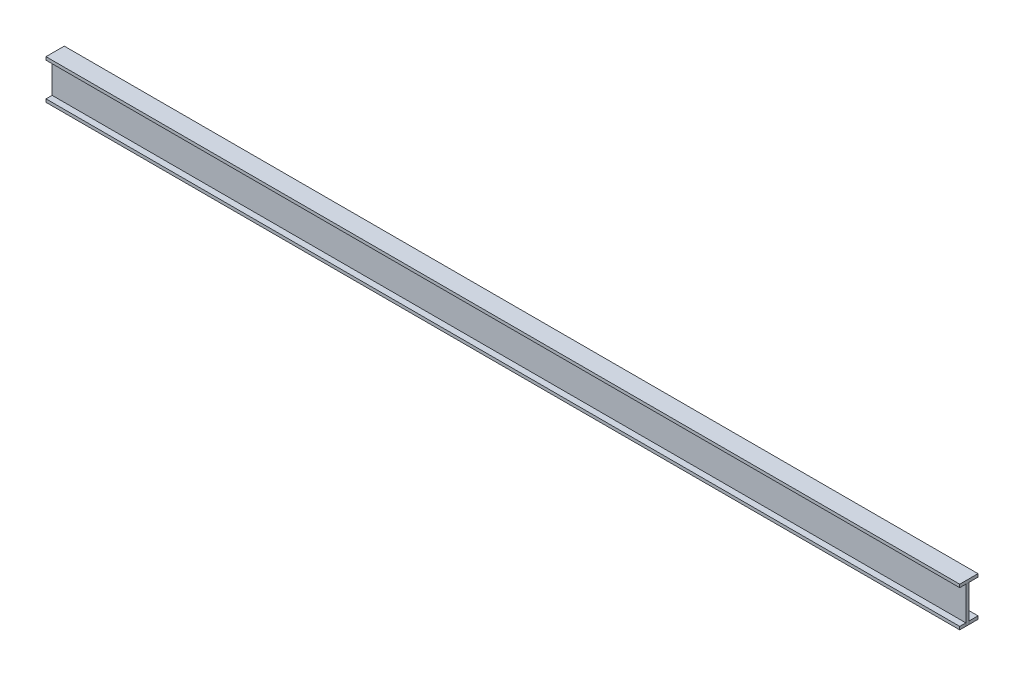
ISO-10303-21;
HEADER;
FILE_DESCRIPTION(('STEP AP214'),'2;1');
FILE_NAME('part.step','',(''),(''),'','','');
FILE_SCHEMA(('AUTOMOTIVE_DESIGN { 1 0 10303 214 1 1 1 1 }'));
ENDSEC;
DATA;
#1=APPLICATION_CONTEXT('core data for automotive mechanical design processes');
#2=APPLICATION_PROTOCOL_DEFINITION('international standard','automotive_design',2000,#1);
#3=PRODUCT_CONTEXT('',#1,'mechanical');
#4=PRODUCT('Part','Part','',(#3));
#5=PRODUCT_RELATED_PRODUCT_CATEGORY('part','',(#4));
#6=PRODUCT_DEFINITION_FORMATION('','',#4);
#7=PRODUCT_DEFINITION_CONTEXT('part definition',#1,'design');
#8=PRODUCT_DEFINITION('design','',#6,#7);
#9=PRODUCT_DEFINITION_SHAPE('','',#8);
#10=(LENGTH_UNIT() NAMED_UNIT(*) SI_UNIT(.MILLI.,.METRE.));
#11=(NAMED_UNIT(*) PLANE_ANGLE_UNIT() SI_UNIT($,.RADIAN.));
#12=(NAMED_UNIT(*) SI_UNIT($,.STERADIAN.) SOLID_ANGLE_UNIT());
#13=UNCERTAINTY_MEASURE_WITH_UNIT(LENGTH_MEASURE(1.E-05),#10,'distance_accuracy_value','');
#14=(GEOMETRIC_REPRESENTATION_CONTEXT(3) GLOBAL_UNCERTAINTY_ASSIGNED_CONTEXT((#13)) GLOBAL_UNIT_ASSIGNED_CONTEXT((#10,
#11,#12)) REPRESENTATION_CONTEXT('',''));
#15=CARTESIAN_POINT('',(0.,0.,0.));
#16=DIRECTION('',(0.,0.,1.));
#17=DIRECTION('',(1.,0.,0.));
#18=AXIS2_PLACEMENT_3D('',#15,#16,#17);
#19=CARTESIAN_POINT('',(3000.,120.,30.));
#20=DIRECTION('',(0.,1.,0.));
#21=DIRECTION('',(0.,0.,1.));
#22=AXIS2_PLACEMENT_3D('',#19,#20,#21);
#23=PLANE('',#22);
#24=DIRECTION('',(0.,0.,-1.));
#25=VECTOR('',#24,1.);
#26=CARTESIAN_POINT('',(0.,120.,30.));
#27=LINE('',#26,#25);
#28=CARTESIAN_POINT('',(0.,120.,30.));
#29=VERTEX_POINT('',#28);
#30=CARTESIAN_POINT('',(0.,120.,-30.));
#31=VERTEX_POINT('',#30);
#32=EDGE_CURVE('E158',#29,#31,#27,.T.);
#33=ORIENTED_EDGE('',*,*,#32,.T.);
#34=DIRECTION('',(-1.,0.,0.));
#35=VECTOR('',#34,1.);
#36=CARTESIAN_POINT('',(3000.,120.,-30.));
#37=LINE('',#36,#35);
#38=CARTESIAN_POINT('',(3000.,120.,-30.));
#39=VERTEX_POINT('',#38);
#40=EDGE_CURVE('E13',#39,#31,#37,.T.);
#41=ORIENTED_EDGE('',*,*,#40,.F.);
#42=DIRECTION('',(0.,0.,-1.));
#43=VECTOR('',#42,1.);
#44=CARTESIAN_POINT('',(3000.,120.,30.));
#45=LINE('',#44,#43);
#46=CARTESIAN_POINT('',(3000.,120.,30.));
#47=VERTEX_POINT('',#46);
#48=EDGE_CURVE('E135',#47,#39,#45,.T.);
#49=ORIENTED_EDGE('',*,*,#48,.F.);
#50=DIRECTION('',(-1.,0.,0.));
#51=VECTOR('',#50,1.);
#52=CARTESIAN_POINT('',(3000.,120.,30.));
#53=LINE('',#52,#51);
#54=EDGE_CURVE('E111',#47,#29,#53,.T.);
#55=ORIENTED_EDGE('',*,*,#54,.T.);
#56=EDGE_LOOP('',(#33,#41,#49,#55));
#57=FACE_BOUND('',#56,.T.);
#58=ADVANCED_FACE('F95',(#57),#23,.F.);
#59=CARTESIAN_POINT('',(3000.,130.,-30.));
#60=DIRECTION('',(0.,0.,-1.));
#61=DIRECTION('',(-1.,0.,0.));
#62=AXIS2_PLACEMENT_3D('',#59,#60,#61);
#63=PLANE('',#62);
#64=DIRECTION('',(0.,-1.,0.));
#65=VECTOR('',#64,1.);
#66=CARTESIAN_POINT('',(0.,130.,-30.));
#67=LINE('',#66,#65);
#68=CARTESIAN_POINT('',(0.,130.,-30.));
#69=VERTEX_POINT('',#68);
#70=EDGE_CURVE('E144',#69,#31,#67,.T.);
#71=ORIENTED_EDGE('',*,*,#70,.F.);
#72=DIRECTION('',(-1.,0.,0.));
#73=VECTOR('',#72,1.);
#74=CARTESIAN_POINT('',(3000.,130.,-30.));
#75=LINE('',#74,#73);
#76=CARTESIAN_POINT('',(3000.,130.,-30.));
#77=VERTEX_POINT('',#76);
#78=EDGE_CURVE('E103',#77,#69,#75,.T.);
#79=ORIENTED_EDGE('',*,*,#78,.F.);
#80=DIRECTION('',(0.,-1.,0.));
#81=VECTOR('',#80,1.);
#82=CARTESIAN_POINT('',(3000.,130.,-30.));
#83=LINE('',#82,#81);
#84=EDGE_CURVE('E142',#77,#39,#83,.T.);
#85=ORIENTED_EDGE('',*,*,#84,.T.);
#86=ORIENTED_EDGE('',*,*,#40,.T.);
#87=EDGE_LOOP('',(#71,#79,#85,#86));
#88=FACE_BOUND('',#87,.T.);
#89=ADVANCED_FACE('F141',(#88),#63,.T.);
#90=CARTESIAN_POINT('',(3000.,130.,30.));
#91=DIRECTION('',(0.,1.,0.));
#92=DIRECTION('',(0.,0.,1.));
#93=AXIS2_PLACEMENT_3D('',#90,#91,#92);
#94=PLANE('',#93);
#95=DIRECTION('',(0.,0.,-1.));
#96=VECTOR('',#95,1.);
#97=CARTESIAN_POINT('',(0.,130.,30.));
#98=LINE('',#97,#96);
#99=CARTESIAN_POINT('',(0.,130.,30.));
#100=VERTEX_POINT('',#99);
#101=EDGE_CURVE('E161',#100,#69,#98,.T.);
#102=ORIENTED_EDGE('',*,*,#101,.F.);
#103=DIRECTION('',(-1.,0.,0.));
#104=VECTOR('',#103,1.);
#105=CARTESIAN_POINT('',(3000.,130.,30.));
#106=LINE('',#105,#104);
#107=CARTESIAN_POINT('',(3000.,130.,30.));
#108=VERTEX_POINT('',#107);
#109=EDGE_CURVE('E124',#108,#100,#106,.T.);
#110=ORIENTED_EDGE('',*,*,#109,.F.);
#111=DIRECTION('',(0.,0.,-1.));
#112=VECTOR('',#111,1.);
#113=CARTESIAN_POINT('',(3000.,130.,30.));
#114=LINE('',#113,#112);
#115=EDGE_CURVE('E150',#108,#77,#114,.T.);
#116=ORIENTED_EDGE('',*,*,#115,.T.);
#117=ORIENTED_EDGE('',*,*,#78,.T.);
#118=EDGE_LOOP('',(#102,#110,#116,#117));
#119=FACE_BOUND('',#118,.T.);
#120=ADVANCED_FACE('F152',(#119),#94,.T.);
#121=CARTESIAN_POINT('',(3000.,120.,30.));
#122=DIRECTION('',(0.,0.,1.));
#123=DIRECTION('',(1.,0.,0.));
#124=AXIS2_PLACEMENT_3D('',#121,#122,#123);
#125=PLANE('',#124);
#126=DIRECTION('',(0.,1.,0.));
#127=VECTOR('',#126,1.);
#128=CARTESIAN_POINT('',(0.,120.,30.));
#129=LINE('',#128,#127);
#130=EDGE_CURVE('E163',#29,#100,#129,.T.);
#131=ORIENTED_EDGE('',*,*,#130,.F.);
#132=ORIENTED_EDGE('',*,*,#54,.F.);
#133=DIRECTION('',(0.,1.,0.));
#134=VECTOR('',#133,1.);
#135=CARTESIAN_POINT('',(3000.,120.,30.));
#136=LINE('',#135,#134);
#137=EDGE_CURVE('E153',#47,#108,#136,.T.);
#138=ORIENTED_EDGE('',*,*,#137,.T.);
#139=ORIENTED_EDGE('',*,*,#109,.T.);
#140=EDGE_LOOP('',(#131,#132,#138,#139));
#141=FACE_BOUND('',#140,.T.);
#142=ADVANCED_FACE('F169',(#141),#125,.T.);
#143=CARTESIAN_POINT('',(3000.,0.,0.));
#144=DIRECTION('',(-1.,0.,0.));
#145=DIRECTION('',(0.,0.,1.));
#146=AXIS2_PLACEMENT_3D('',#143,#144,#145);
#147=PLANE('',#146);
#148=ORIENTED_EDGE('',*,*,#48,.T.);
#149=ORIENTED_EDGE('',*,*,#84,.F.);
#150=ORIENTED_EDGE('',*,*,#115,.F.);
#151=ORIENTED_EDGE('',*,*,#137,.F.);
#152=EDGE_LOOP('',(#148,#149,#150,#151));
#153=FACE_BOUND('',#152,.T.);
#154=ADVANCED_FACE('F149',(#153),#147,.F.);
#155=CARTESIAN_POINT('',(0.,0.,0.));
#156=DIRECTION('',(-1.,0.,0.));
#157=DIRECTION('',(0.,0.,1.));
#158=AXIS2_PLACEMENT_3D('',#155,#156,#157);
#159=PLANE('',#158);
#160=ORIENTED_EDGE('',*,*,#32,.F.);
#161=ORIENTED_EDGE('',*,*,#130,.T.);
#162=ORIENTED_EDGE('',*,*,#101,.T.);
#163=ORIENTED_EDGE('',*,*,#70,.T.);
#164=EDGE_LOOP('',(#160,#161,#162,#163));
#165=FACE_BOUND('',#164,.T.);
#166=ADVANCED_FACE('F168',(#165),#159,.T.);
#167=CLOSED_SHELL('',(#58,#89,#120,#142,#154,#166));
#168=MANIFOLD_SOLID_BREP('B2',#167);
#169=CARTESIAN_POINT('',(3000.,0.,0.));
#170=DIRECTION('',(0.,0.,1.));
#171=DIRECTION('',(1.,0.,0.));
#172=AXIS2_PLACEMENT_3D('',#169,#170,#171);
#173=PLANE('',#172);
#174=DIRECTION('',(0.,1.,0.));
#175=VECTOR('',#174,1.);
#176=CARTESIAN_POINT('',(0.,0.,0.));
#177=LINE('',#176,#175);
#178=CARTESIAN_POINT('',(0.,0.,0.));
#179=VERTEX_POINT('',#178);
#180=CARTESIAN_POINT('',(0.,120.,0.));
#181=VERTEX_POINT('',#180);
#182=EDGE_CURVE('E290',#179,#181,#177,.T.);
#183=ORIENTED_EDGE('',*,*,#182,.T.);
#184=DIRECTION('',(-1.,0.,0.));
#185=VECTOR('',#184,1.);
#186=CARTESIAN_POINT('',(3000.,120.,0.));
#187=LINE('',#186,#185);
#188=CARTESIAN_POINT('',(3000.,120.,0.));
#189=VERTEX_POINT('',#188);
#190=EDGE_CURVE('E93',#189,#181,#187,.T.);
#191=ORIENTED_EDGE('',*,*,#190,.F.);
#192=DIRECTION('',(0.,1.,0.));
#193=VECTOR('',#192,1.);
#194=CARTESIAN_POINT('',(3000.,0.,0.));
#195=LINE('',#194,#193);
#196=CARTESIAN_POINT('',(3000.,0.,0.));
#197=VERTEX_POINT('',#196);
#198=EDGE_CURVE('E267',#197,#189,#195,.T.);
#199=ORIENTED_EDGE('',*,*,#198,.F.);
#200=DIRECTION('',(-1.,0.,0.));
#201=VECTOR('',#200,1.);
#202=CARTESIAN_POINT('',(3000.,0.,0.));
#203=LINE('',#202,#201);
#204=EDGE_CURVE('E243',#197,#179,#203,.T.);
#205=ORIENTED_EDGE('',*,*,#204,.T.);
#206=EDGE_LOOP('',(#183,#191,#199,#205));
#207=FACE_BOUND('',#206,.T.);
#208=ADVANCED_FACE('F227',(#207),#173,.F.);
#209=CARTESIAN_POINT('',(3000.,120.,10.));
#210=DIRECTION('',(0.,1.,0.));
#211=DIRECTION('',(0.,0.,1.));
#212=AXIS2_PLACEMENT_3D('',#209,#210,#211);
#213=PLANE('',#212);
#214=DIRECTION('',(0.,0.,-1.));
#215=VECTOR('',#214,1.);
#216=CARTESIAN_POINT('',(0.,120.,10.));
#217=LINE('',#216,#215);
#218=CARTESIAN_POINT('',(0.,120.,10.));
#219=VERTEX_POINT('',#218);
#220=EDGE_CURVE('E276',#219,#181,#217,.T.);
#221=ORIENTED_EDGE('',*,*,#220,.F.);
#222=DIRECTION('',(-1.,0.,0.));
#223=VECTOR('',#222,1.);
#224=CARTESIAN_POINT('',(3000.,120.,10.));
#225=LINE('',#224,#223);
#226=CARTESIAN_POINT('',(3000.,120.,10.));
#227=VERTEX_POINT('',#226);
#228=EDGE_CURVE('E235',#227,#219,#225,.T.);
#229=ORIENTED_EDGE('',*,*,#228,.F.);
#230=DIRECTION('',(0.,0.,-1.));
#231=VECTOR('',#230,1.);
#232=CARTESIAN_POINT('',(3000.,120.,10.));
#233=LINE('',#232,#231);
#234=EDGE_CURVE('E274',#227,#189,#233,.T.);
#235=ORIENTED_EDGE('',*,*,#234,.T.);
#236=ORIENTED_EDGE('',*,*,#190,.T.);
#237=EDGE_LOOP('',(#221,#229,#235,#236));
#238=FACE_BOUND('',#237,.T.);
#239=ADVANCED_FACE('F273',(#238),#213,.T.);
#240=CARTESIAN_POINT('',(3000.,0.,10.));
#241=DIRECTION('',(0.,0.,1.));
#242=DIRECTION('',(1.,0.,0.));
#243=AXIS2_PLACEMENT_3D('',#240,#241,#242);
#244=PLANE('',#243);
#245=DIRECTION('',(0.,1.,0.));
#246=VECTOR('',#245,1.);
#247=CARTESIAN_POINT('',(0.,0.,10.));
#248=LINE('',#247,#246);
#249=CARTESIAN_POINT('',(0.,0.,10.));
#250=VERTEX_POINT('',#249);
#251=EDGE_CURVE('E293',#250,#219,#248,.T.);
#252=ORIENTED_EDGE('',*,*,#251,.F.);
#253=DIRECTION('',(-1.,0.,0.));
#254=VECTOR('',#253,1.);
#255=CARTESIAN_POINT('',(3000.,0.,10.));
#256=LINE('',#255,#254);
#257=CARTESIAN_POINT('',(3000.,0.,10.));
#258=VERTEX_POINT('',#257);
#259=EDGE_CURVE('E256',#258,#250,#256,.T.);
#260=ORIENTED_EDGE('',*,*,#259,.F.);
#261=DIRECTION('',(0.,1.,0.));
#262=VECTOR('',#261,1.);
#263=CARTESIAN_POINT('',(3000.,0.,10.));
#264=LINE('',#263,#262);
#265=EDGE_CURVE('E282',#258,#227,#264,.T.);
#266=ORIENTED_EDGE('',*,*,#265,.T.);
#267=ORIENTED_EDGE('',*,*,#228,.T.);
#268=EDGE_LOOP('',(#252,#260,#266,#267));
#269=FACE_BOUND('',#268,.T.);
#270=ADVANCED_FACE('F284',(#269),#244,.T.);
#271=CARTESIAN_POINT('',(3000.,0.,0.));
#272=DIRECTION('',(0.,-1.,0.));
#273=DIRECTION('',(0.,0.,-1.));
#274=AXIS2_PLACEMENT_3D('',#271,#272,#273);
#275=PLANE('',#274);
#276=DIRECTION('',(0.,0.,1.));
#277=VECTOR('',#276,1.);
#278=CARTESIAN_POINT('',(0.,0.,0.));
#279=LINE('',#278,#277);
#280=EDGE_CURVE('E295',#179,#250,#279,.T.);
#281=ORIENTED_EDGE('',*,*,#280,.F.);
#282=ORIENTED_EDGE('',*,*,#204,.F.);
#283=DIRECTION('',(0.,0.,1.));
#284=VECTOR('',#283,1.);
#285=CARTESIAN_POINT('',(3000.,0.,0.));
#286=LINE('',#285,#284);
#287=EDGE_CURVE('E285',#197,#258,#286,.T.);
#288=ORIENTED_EDGE('',*,*,#287,.T.);
#289=ORIENTED_EDGE('',*,*,#259,.T.);
#290=EDGE_LOOP('',(#281,#282,#288,#289));
#291=FACE_BOUND('',#290,.T.);
#292=ADVANCED_FACE('F301',(#291),#275,.T.);
#293=CARTESIAN_POINT('',(3000.,0.,0.));
#294=DIRECTION('',(-1.,0.,0.));
#295=DIRECTION('',(0.,0.,1.));
#296=AXIS2_PLACEMENT_3D('',#293,#294,#295);
#297=PLANE('',#296);
#298=ORIENTED_EDGE('',*,*,#198,.T.);
#299=ORIENTED_EDGE('',*,*,#234,.F.);
#300=ORIENTED_EDGE('',*,*,#265,.F.);
#301=ORIENTED_EDGE('',*,*,#287,.F.);
#302=EDGE_LOOP('',(#298,#299,#300,#301));
#303=FACE_BOUND('',#302,.T.);
#304=ADVANCED_FACE('F281',(#303),#297,.F.);
#305=CARTESIAN_POINT('',(0.,0.,0.));
#306=DIRECTION('',(-1.,0.,0.));
#307=DIRECTION('',(0.,0.,1.));
#308=AXIS2_PLACEMENT_3D('',#305,#306,#307);
#309=PLANE('',#308);
#310=ORIENTED_EDGE('',*,*,#182,.F.);
#311=ORIENTED_EDGE('',*,*,#280,.T.);
#312=ORIENTED_EDGE('',*,*,#251,.T.);
#313=ORIENTED_EDGE('',*,*,#220,.T.);
#314=EDGE_LOOP('',(#310,#311,#312,#313));
#315=FACE_BOUND('',#314,.T.);
#316=ADVANCED_FACE('F300',(#315),#309,.T.);
#317=CLOSED_SHELL('',(#208,#239,#270,#292,#304,#316));
#318=MANIFOLD_SOLID_BREP('B7',#317);
#319=CARTESIAN_POINT('',(3000.,0.,30.));
#320=DIRECTION('',(0.,1.,0.));
#321=DIRECTION('',(0.,0.,1.));
#322=AXIS2_PLACEMENT_3D('',#319,#320,#321);
#323=PLANE('',#322);
#324=DIRECTION('',(0.,0.,-1.));
#325=VECTOR('',#324,1.);
#326=CARTESIAN_POINT('',(0.,0.,30.));
#327=LINE('',#326,#325);
#328=CARTESIAN_POINT('',(0.,0.,30.));
#329=VERTEX_POINT('',#328);
#330=CARTESIAN_POINT('',(0.,0.,-30.));
#331=VERTEX_POINT('',#330);
#332=EDGE_CURVE('E413',#329,#331,#327,.T.);
#333=ORIENTED_EDGE('',*,*,#332,.T.);
#334=DIRECTION('',(-1.,0.,0.));
#335=VECTOR('',#334,1.);
#336=CARTESIAN_POINT('',(3000.,0.,-30.));
#337=LINE('',#336,#335);
#338=CARTESIAN_POINT('',(3000.,0.,-30.));
#339=VERTEX_POINT('',#338);
#340=EDGE_CURVE('E225',#339,#331,#337,.T.);
#341=ORIENTED_EDGE('',*,*,#340,.F.);
#342=DIRECTION('',(0.,0.,-1.));
#343=VECTOR('',#342,1.);
#344=CARTESIAN_POINT('',(3000.,0.,30.));
#345=LINE('',#344,#343);
#346=CARTESIAN_POINT('',(3000.,0.,30.));
#347=VERTEX_POINT('',#346);
#348=EDGE_CURVE('E390',#347,#339,#345,.T.);
#349=ORIENTED_EDGE('',*,*,#348,.F.);
#350=DIRECTION('',(-1.,0.,0.));
#351=VECTOR('',#350,1.);
#352=CARTESIAN_POINT('',(3000.,0.,30.));
#353=LINE('',#352,#351);
#354=EDGE_CURVE('E366',#347,#329,#353,.T.);
#355=ORIENTED_EDGE('',*,*,#354,.T.);
#356=EDGE_LOOP('',(#333,#341,#349,#355));
#357=FACE_BOUND('',#356,.T.);
#358=ADVANCED_FACE('F350',(#357),#323,.F.);
#359=CARTESIAN_POINT('',(3000.,10.,-30.));
#360=DIRECTION('',(0.,0.,-1.));
#361=DIRECTION('',(-1.,0.,0.));
#362=AXIS2_PLACEMENT_3D('',#359,#360,#361);
#363=PLANE('',#362);
#364=DIRECTION('',(0.,-1.,0.));
#365=VECTOR('',#364,1.);
#366=CARTESIAN_POINT('',(0.,10.,-30.));
#367=LINE('',#366,#365);
#368=CARTESIAN_POINT('',(0.,10.,-30.));
#369=VERTEX_POINT('',#368);
#370=EDGE_CURVE('E399',#369,#331,#367,.T.);
#371=ORIENTED_EDGE('',*,*,#370,.F.);
#372=DIRECTION('',(-1.,0.,0.));
#373=VECTOR('',#372,1.);
#374=CARTESIAN_POINT('',(3000.,10.,-30.));
#375=LINE('',#374,#373);
#376=CARTESIAN_POINT('',(3000.,10.,-30.));
#377=VERTEX_POINT('',#376);
#378=EDGE_CURVE('E358',#377,#369,#375,.T.);
#379=ORIENTED_EDGE('',*,*,#378,.F.);
#380=DIRECTION('',(0.,-1.,0.));
#381=VECTOR('',#380,1.);
#382=CARTESIAN_POINT('',(3000.,10.,-30.));
#383=LINE('',#382,#381);
#384=EDGE_CURVE('E397',#377,#339,#383,.T.);
#385=ORIENTED_EDGE('',*,*,#384,.T.);
#386=ORIENTED_EDGE('',*,*,#340,.T.);
#387=EDGE_LOOP('',(#371,#379,#385,#386));
#388=FACE_BOUND('',#387,.T.);
#389=ADVANCED_FACE('F396',(#388),#363,.T.);
#390=CARTESIAN_POINT('',(3000.,10.,30.));
#391=DIRECTION('',(0.,1.,0.));
#392=DIRECTION('',(0.,0.,1.));
#393=AXIS2_PLACEMENT_3D('',#390,#391,#392);
#394=PLANE('',#393);
#395=DIRECTION('',(0.,0.,-1.));
#396=VECTOR('',#395,1.);
#397=CARTESIAN_POINT('',(0.,10.,30.));
#398=LINE('',#397,#396);
#399=CARTESIAN_POINT('',(0.,10.,30.));
#400=VERTEX_POINT('',#399);
#401=EDGE_CURVE('E416',#400,#369,#398,.T.);
#402=ORIENTED_EDGE('',*,*,#401,.F.);
#403=DIRECTION('',(-1.,0.,0.));
#404=VECTOR('',#403,1.);
#405=CARTESIAN_POINT('',(3000.,10.,30.));
#406=LINE('',#405,#404);
#407=CARTESIAN_POINT('',(3000.,10.,30.));
#408=VERTEX_POINT('',#407);
#409=EDGE_CURVE('E379',#408,#400,#406,.T.);
#410=ORIENTED_EDGE('',*,*,#409,.F.);
#411=DIRECTION('',(0.,0.,-1.));
#412=VECTOR('',#411,1.);
#413=CARTESIAN_POINT('',(3000.,10.,30.));
#414=LINE('',#413,#412);
#415=EDGE_CURVE('E405',#408,#377,#414,.T.);
#416=ORIENTED_EDGE('',*,*,#415,.T.);
#417=ORIENTED_EDGE('',*,*,#378,.T.);
#418=EDGE_LOOP('',(#402,#410,#416,#417));
#419=FACE_BOUND('',#418,.T.);
#420=ADVANCED_FACE('F407',(#419),#394,.T.);
#421=CARTESIAN_POINT('',(3000.,0.,30.));
#422=DIRECTION('',(0.,0.,1.));
#423=DIRECTION('',(1.,0.,0.));
#424=AXIS2_PLACEMENT_3D('',#421,#422,#423);
#425=PLANE('',#424);
#426=DIRECTION('',(0.,1.,0.));
#427=VECTOR('',#426,1.);
#428=CARTESIAN_POINT('',(0.,0.,30.));
#429=LINE('',#428,#427);
#430=EDGE_CURVE('E418',#329,#400,#429,.T.);
#431=ORIENTED_EDGE('',*,*,#430,.F.);
#432=ORIENTED_EDGE('',*,*,#354,.F.);
#433=DIRECTION('',(0.,1.,0.));
#434=VECTOR('',#433,1.);
#435=CARTESIAN_POINT('',(3000.,0.,30.));
#436=LINE('',#435,#434);
#437=EDGE_CURVE('E408',#347,#408,#436,.T.);
#438=ORIENTED_EDGE('',*,*,#437,.T.);
#439=ORIENTED_EDGE('',*,*,#409,.T.);
#440=EDGE_LOOP('',(#431,#432,#438,#439));
#441=FACE_BOUND('',#440,.T.);
#442=ADVANCED_FACE('F424',(#441),#425,.T.);
#443=CARTESIAN_POINT('',(3000.,0.,0.));
#444=DIRECTION('',(-1.,0.,0.));
#445=DIRECTION('',(0.,0.,1.));
#446=AXIS2_PLACEMENT_3D('',#443,#444,#445);
#447=PLANE('',#446);
#448=ORIENTED_EDGE('',*,*,#348,.T.);
#449=ORIENTED_EDGE('',*,*,#384,.F.);
#450=ORIENTED_EDGE('',*,*,#415,.F.);
#451=ORIENTED_EDGE('',*,*,#437,.F.);
#452=EDGE_LOOP('',(#448,#449,#450,#451));
#453=FACE_BOUND('',#452,.T.);
#454=ADVANCED_FACE('F404',(#453),#447,.F.);
#455=CARTESIAN_POINT('',(0.,0.,0.));
#456=DIRECTION('',(-1.,0.,0.));
#457=DIRECTION('',(0.,0.,1.));
#458=AXIS2_PLACEMENT_3D('',#455,#456,#457);
#459=PLANE('',#458);
#460=ORIENTED_EDGE('',*,*,#332,.F.);
#461=ORIENTED_EDGE('',*,*,#430,.T.);
#462=ORIENTED_EDGE('',*,*,#401,.T.);
#463=ORIENTED_EDGE('',*,*,#370,.T.);
#464=EDGE_LOOP('',(#460,#461,#462,#463));
#465=FACE_BOUND('',#464,.T.);
#466=ADVANCED_FACE('F423',(#465),#459,.T.);
#467=CLOSED_SHELL('',(#358,#389,#420,#442,#454,#466));
#468=MANIFOLD_SOLID_BREP('B87',#467);
#469=ADVANCED_BREP_SHAPE_REPRESENTATION('',(#18,#168,#318,#468),#14);
#470=SHAPE_DEFINITION_REPRESENTATION(#9,#469);
ENDSEC;
END-ISO-10303-21;
